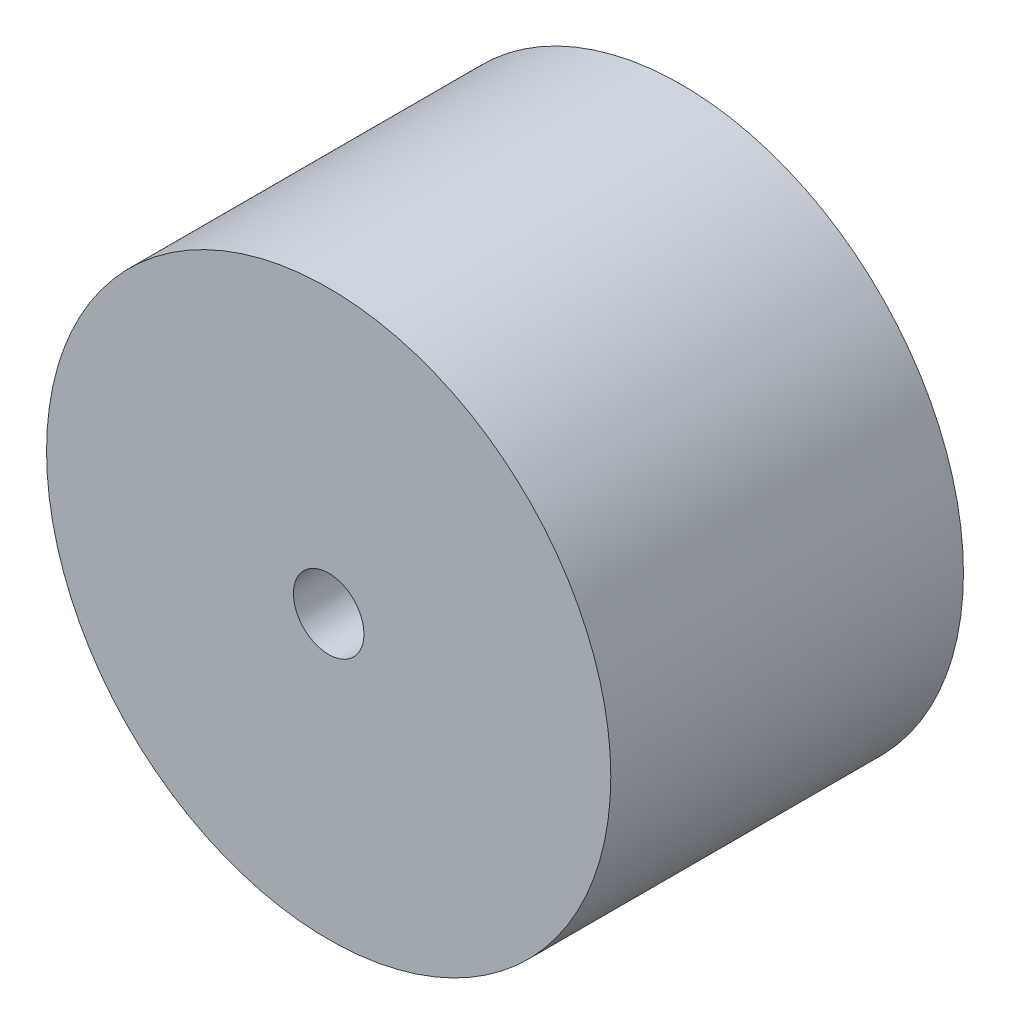
ISO-10303-21;
HEADER;
FILE_DESCRIPTION(('STEP AP214'),'2;1');
FILE_NAME('part.step','',(''),(''),'','','');
FILE_SCHEMA(('AUTOMOTIVE_DESIGN { 1 0 10303 214 1 1 1 1 }'));
ENDSEC;
DATA;
#1=APPLICATION_CONTEXT('core data for automotive mechanical design processes');
#2=APPLICATION_PROTOCOL_DEFINITION('international standard','automotive_design',2000,#1);
#3=PRODUCT_CONTEXT('',#1,'mechanical');
#4=PRODUCT('Part','Part','',(#3));
#5=PRODUCT_RELATED_PRODUCT_CATEGORY('part','',(#4));
#6=PRODUCT_DEFINITION_FORMATION('','',#4);
#7=PRODUCT_DEFINITION_CONTEXT('part definition',#1,'design');
#8=PRODUCT_DEFINITION('design','',#6,#7);
#9=PRODUCT_DEFINITION_SHAPE('','',#8);
#10=(LENGTH_UNIT() NAMED_UNIT(*) SI_UNIT(.MILLI.,.METRE.));
#11=(NAMED_UNIT(*) PLANE_ANGLE_UNIT() SI_UNIT($,.RADIAN.));
#12=(NAMED_UNIT(*) SI_UNIT($,.STERADIAN.) SOLID_ANGLE_UNIT());
#13=UNCERTAINTY_MEASURE_WITH_UNIT(LENGTH_MEASURE(1.E-05),#10,'distance_accuracy_value','');
#14=(GEOMETRIC_REPRESENTATION_CONTEXT(3) GLOBAL_UNCERTAINTY_ASSIGNED_CONTEXT((#13)) GLOBAL_UNIT_ASSIGNED_CONTEXT((#10,
#11,#12)) REPRESENTATION_CONTEXT('',''));
#15=CARTESIAN_POINT('',(0.,0.,0.));
#16=DIRECTION('',(0.,0.,1.));
#17=DIRECTION('',(1.,0.,0.));
#18=AXIS2_PLACEMENT_3D('',#15,#16,#17);
#19=CARTESIAN_POINT('',(0.,0.,50.));
#20=DIRECTION('',(0.,0.,1.));
#21=DIRECTION('',(1.,0.,0.));
#22=AXIS2_PLACEMENT_3D('',#19,#20,#21);
#23=PLANE('',#22);
#24=CARTESIAN_POINT('',(0.,0.,50.));
#25=DIRECTION('',(0.,0.,1.));
#26=DIRECTION('',(1.,0.,0.));
#27=AXIS2_PLACEMENT_3D('',#24,#25,#26);
#28=CIRCLE('',#27,40.);
#29=CARTESIAN_POINT('',(40.,0.,50.));
#30=VERTEX_POINT('',#29);
#31=EDGE_CURVE('E10',#30,#30,#28,.T.);
#32=ORIENTED_EDGE('',*,*,#31,.T.);
#33=EDGE_LOOP('',(#32));
#34=FACE_BOUND('',#33,.T.);
#35=CARTESIAN_POINT('',(0.,0.,50.));
#36=DIRECTION('',(0.,0.,1.));
#37=DIRECTION('',(1.,0.,0.));
#38=AXIS2_PLACEMENT_3D('',#35,#36,#37);
#39=CIRCLE('',#38,5.);
#40=CARTESIAN_POINT('',(5.,0.,50.));
#41=VERTEX_POINT('',#40);
#42=EDGE_CURVE('E50',#41,#41,#39,.T.);
#43=ORIENTED_EDGE('',*,*,#42,.F.);
#44=EDGE_LOOP('',(#43));
#45=FACE_BOUND('',#44,.T.);
#46=ADVANCED_FACE('F37',(#34,#45),#23,.T.);
#47=CARTESIAN_POINT('',(0.,0.,0.));
#48=DIRECTION('',(0.,0.,1.));
#49=DIRECTION('',(1.,0.,0.));
#50=AXIS2_PLACEMENT_3D('',#47,#48,#49);
#51=PLANE('',#50);
#52=CARTESIAN_POINT('',(0.,0.,0.));
#53=DIRECTION('',(0.,0.,1.));
#54=DIRECTION('',(1.,0.,0.));
#55=AXIS2_PLACEMENT_3D('',#52,#53,#54);
#56=CIRCLE('',#55,40.);
#57=CARTESIAN_POINT('',(40.,0.,0.));
#58=VERTEX_POINT('',#57);
#59=EDGE_CURVE('E41',#58,#58,#56,.T.);
#60=ORIENTED_EDGE('',*,*,#59,.F.);
#61=EDGE_LOOP('',(#60));
#62=FACE_BOUND('',#61,.T.);
#63=CARTESIAN_POINT('',(0.,0.,0.));
#64=DIRECTION('',(0.,0.,1.));
#65=DIRECTION('',(1.,0.,0.));
#66=AXIS2_PLACEMENT_3D('',#63,#64,#65);
#67=CIRCLE('',#66,5.);
#68=CARTESIAN_POINT('',(5.,0.,0.));
#69=VERTEX_POINT('',#68);
#70=EDGE_CURVE('E52',#69,#69,#67,.T.);
#71=ORIENTED_EDGE('',*,*,#70,.T.);
#72=EDGE_LOOP('',(#71));
#73=FACE_BOUND('',#72,.T.);
#74=ADVANCED_FACE('F64',(#62,#73),#51,.F.);
#75=CARTESIAN_POINT('',(0.,0.,50.));
#76=DIRECTION('',(0.,0.,-1.));
#77=DIRECTION('',(-1.,0.,0.));
#78=AXIS2_PLACEMENT_3D('',#75,#76,#77);
#79=CYLINDRICAL_SURFACE('',#78,40.);
#80=ORIENTED_EDGE('',*,*,#31,.F.);
#81=EDGE_LOOP('',(#80));
#82=FACE_BOUND('',#81,.T.);
#83=ORIENTED_EDGE('',*,*,#59,.T.);
#84=EDGE_LOOP('',(#83));
#85=FACE_BOUND('',#84,.T.);
#86=ADVANCED_FACE('F39',(#82,#85),#79,.T.);
#87=CARTESIAN_POINT('',(0.,0.,50.));
#88=DIRECTION('',(0.,0.,-1.));
#89=DIRECTION('',(-1.,0.,0.));
#90=AXIS2_PLACEMENT_3D('',#87,#88,#89);
#91=CYLINDRICAL_SURFACE('',#90,5.);
#92=ORIENTED_EDGE('',*,*,#42,.T.);
#93=EDGE_LOOP('',(#92));
#94=FACE_BOUND('',#93,.T.);
#95=ORIENTED_EDGE('',*,*,#70,.F.);
#96=EDGE_LOOP('',(#95));
#97=FACE_BOUND('',#96,.T.);
#98=ADVANCED_FACE('F60',(#94,#97),#91,.F.);
#99=CLOSED_SHELL('',(#46,#74,#86,#98));
#100=MANIFOLD_SOLID_BREP('B2',#99);
#101=ADVANCED_BREP_SHAPE_REPRESENTATION('',(#18,#100),#14);
#102=SHAPE_DEFINITION_REPRESENTATION(#9,#101);
ENDSEC;
END-ISO-10303-21;
